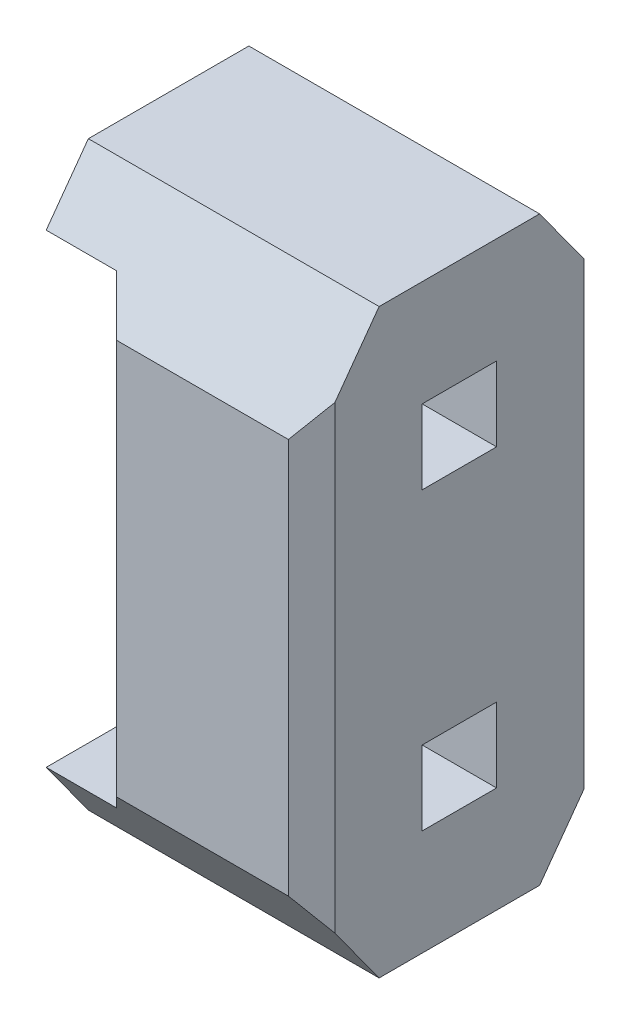
ISO-10303-21;
HEADER;
FILE_DESCRIPTION(('STEP AP214'),'2;1');
FILE_NAME('part.step','',(''),(''),'','','');
FILE_SCHEMA(('AUTOMOTIVE_DESIGN { 1 0 10303 214 1 1 1 1 }'));
ENDSEC;
DATA;
#1=APPLICATION_CONTEXT('core data for automotive mechanical design processes');
#2=APPLICATION_PROTOCOL_DEFINITION('international standard','automotive_design',2000,#1);
#3=PRODUCT_CONTEXT('',#1,'mechanical');
#4=PRODUCT('Part','Part','',(#3));
#5=PRODUCT_RELATED_PRODUCT_CATEGORY('part','',(#4));
#6=PRODUCT_DEFINITION_FORMATION('','',#4);
#7=PRODUCT_DEFINITION_CONTEXT('part definition',#1,'design');
#8=PRODUCT_DEFINITION('design','',#6,#7);
#9=PRODUCT_DEFINITION_SHAPE('','',#8);
#10=(LENGTH_UNIT() NAMED_UNIT(*) SI_UNIT(.MILLI.,.METRE.));
#11=(NAMED_UNIT(*) PLANE_ANGLE_UNIT() SI_UNIT($,.RADIAN.));
#12=(NAMED_UNIT(*) SI_UNIT($,.STERADIAN.) SOLID_ANGLE_UNIT());
#13=UNCERTAINTY_MEASURE_WITH_UNIT(LENGTH_MEASURE(1.E-05),#10,'distance_accuracy_value','');
#14=(GEOMETRIC_REPRESENTATION_CONTEXT(3) GLOBAL_UNCERTAINTY_ASSIGNED_CONTEXT((#13)) GLOBAL_UNIT_ASSIGNED_CONTEXT((#10,
#11,#12)) REPRESENTATION_CONTEXT('',''));
#15=CARTESIAN_POINT('',(0.,0.,0.));
#16=DIRECTION('',(0.,0.,1.));
#17=DIRECTION('',(1.,0.,0.));
#18=AXIS2_PLACEMENT_3D('',#15,#16,#17);
#19=CARTESIAN_POINT('',(1.25,4.6,-2.83));
#20=DIRECTION('',(0.,0.586967571460905,0.809610443394407));
#21=DIRECTION('',(0.,-0.809610443394407,0.586967571460905));
#22=AXIS2_PLACEMENT_3D('',#19,#20,#21);
#23=PLANE('',#22);
#24=DIRECTION('',(1.,0.,0.));
#25=VECTOR('',#24,1.);
#26=CARTESIAN_POINT('',(1.25,4.5,-2.7575));
#27=LINE('',#26,#25);
#28=CARTESIAN_POINT('',(0.,4.5,-2.7575));
#29=VERTEX_POINT('',#28);
#30=CARTESIAN_POINT('',(0.602500000000036,4.5,-2.75750000000004));
#31=VERTEX_POINT('',#30);
#32=EDGE_CURVE('E199',#29,#31,#27,.T.);
#33=ORIENTED_EDGE('',*,*,#32,.T.);
#34=DIRECTION('',(0.506207656349388,-0.698217457033655,0.506207656349365));
#35=VECTOR('',#34,1.);
#36=CARTESIAN_POINT('',(0.6025,4.5,-2.7575));
#37=LINE('',#36,#35);
#38=CARTESIAN_POINT('',(0.819999999999963,4.2,-2.53999999999997));
#39=VERTEX_POINT('',#38);
#40=EDGE_CURVE('E197',#31,#39,#37,.T.);
#41=ORIENTED_EDGE('',*,*,#40,.T.);
#42=DIRECTION('',(1.,0.,0.));
#43=VECTOR('',#42,1.);
#44=CARTESIAN_POINT('',(1.25,4.19999999999999,-2.54000000000001));
#45=LINE('',#44,#43);
#46=CARTESIAN_POINT('',(2.3,4.2,-2.54000000000001));
#47=VERTEX_POINT('',#46);
#48=EDGE_CURVE('E20',#39,#47,#45,.T.);
#49=ORIENTED_EDGE('',*,*,#48,.T.);
#50=DIRECTION('',(0.506207656348956,0.69821745703386,-0.506207656349513));
#51=VECTOR('',#50,1.);
#52=CARTESIAN_POINT('',(2.3,4.19999999999999,-2.54000000000001));
#53=LINE('',#52,#51);
#54=CARTESIAN_POINT('',(2.5,4.47586206896591,-2.74000000000012));
#55=VERTEX_POINT('',#54);
#56=EDGE_CURVE('E181',#47,#55,#53,.T.);
#57=ORIENTED_EDGE('',*,*,#56,.T.);
#58=DIRECTION('',(0.,-0.809610443394407,0.586967571460905));
#59=VECTOR('',#58,1.);
#60=CARTESIAN_POINT('',(2.5,4.6,-2.83));
#61=LINE('',#60,#59);
#62=CARTESIAN_POINT('',(2.5,5.,-3.11999999999999));
#63=VERTEX_POINT('',#62);
#64=EDGE_CURVE('E188',#55,#63,#61,.F.);
#65=ORIENTED_EDGE('',*,*,#64,.T.);
#66=DIRECTION('',(1.,0.,0.));
#67=VECTOR('',#66,1.);
#68=CARTESIAN_POINT('',(1.25,5.,-3.12));
#69=LINE('',#68,#67);
#70=CARTESIAN_POINT('',(0.,5.,-3.11999999999999));
#71=VERTEX_POINT('',#70);
#72=EDGE_CURVE('E215',#71,#63,#69,.T.);
#73=ORIENTED_EDGE('',*,*,#72,.F.);
#74=DIRECTION('',(0.,-0.809610443394407,0.586967571460905));
#75=VECTOR('',#74,1.);
#76=CARTESIAN_POINT('',(0.,4.6,-2.83));
#77=LINE('',#76,#75);
#78=EDGE_CURVE('E207',#71,#29,#77,.T.);
#79=ORIENTED_EDGE('',*,*,#78,.T.);
#80=EDGE_LOOP('',(#33,#41,#49,#57,#65,#73,#79));
#81=FACE_BOUND('',#80,.T.);
#82=ADVANCED_FACE('F17',(#81),#23,.T.);
#83=CARTESIAN_POINT('',(1.25,4.6,-4.79));
#84=DIRECTION('',(0.,-0.586967571460905,0.809610443394407));
#85=DIRECTION('',(0.,-0.809610443394407,-0.586967571460905));
#86=AXIS2_PLACEMENT_3D('',#83,#84,#85);
#87=PLANE('',#86);
#88=DIRECTION('',(0.,-0.809610443394407,-0.586967571460905));
#89=VECTOR('',#88,1.);
#90=CARTESIAN_POINT('',(0.,4.6,-4.79));
#91=LINE('',#90,#89);
#92=CARTESIAN_POINT('',(0.,5.,-4.50000000000001));
#93=VERTEX_POINT('',#92);
#94=CARTESIAN_POINT('',(0.,4.5,-4.8625));
#95=VERTEX_POINT('',#94);
#96=EDGE_CURVE('E263',#93,#95,#91,.T.);
#97=ORIENTED_EDGE('',*,*,#96,.F.);
#98=DIRECTION('',(1.,0.,0.));
#99=VECTOR('',#98,1.);
#100=CARTESIAN_POINT('',(1.25,5.,-4.5));
#101=LINE('',#100,#99);
#102=CARTESIAN_POINT('',(2.5,5.,-4.5));
#103=VERTEX_POINT('',#102);
#104=EDGE_CURVE('E227',#103,#93,#101,.F.);
#105=ORIENTED_EDGE('',*,*,#104,.F.);
#106=DIRECTION('',(0.,-0.809610443394407,-0.586967571460905));
#107=VECTOR('',#106,1.);
#108=CARTESIAN_POINT('',(2.5,4.6,-4.79));
#109=LINE('',#108,#107);
#110=CARTESIAN_POINT('',(2.5,4.47586206896592,-4.87999999999988));
#111=VERTEX_POINT('',#110);
#112=EDGE_CURVE('E223',#111,#103,#109,.F.);
#113=ORIENTED_EDGE('',*,*,#112,.F.);
#114=DIRECTION('',(0.506207656348956,0.69821745703386,0.506207656349513));
#115=VECTOR('',#114,1.);
#116=CARTESIAN_POINT('',(2.3,4.19999999999999,-5.07999999999999));
#117=LINE('',#116,#115);
#118=CARTESIAN_POINT('',(2.3,4.2,-5.07999999999999));
#119=VERTEX_POINT('',#118);
#120=EDGE_CURVE('E266',#119,#111,#117,.T.);
#121=ORIENTED_EDGE('',*,*,#120,.F.);
#122=DIRECTION('',(1.,0.,0.));
#123=VECTOR('',#122,1.);
#124=CARTESIAN_POINT('',(1.25,4.19999999999999,-5.07999999999999));
#125=LINE('',#124,#123);
#126=CARTESIAN_POINT('',(0.819999999999963,4.2,-5.08000000000003));
#127=VERTEX_POINT('',#126);
#128=EDGE_CURVE('E205',#127,#119,#125,.T.);
#129=ORIENTED_EDGE('',*,*,#128,.F.);
#130=DIRECTION('',(0.506207656349388,-0.698217457033654,-0.506207656349365));
#131=VECTOR('',#130,1.);
#132=CARTESIAN_POINT('',(0.6025,4.5,-4.8625));
#133=LINE('',#132,#131);
#134=CARTESIAN_POINT('',(0.602500000000036,4.5,-4.86249999999996));
#135=VERTEX_POINT('',#134);
#136=EDGE_CURVE('E203',#135,#127,#133,.T.);
#137=ORIENTED_EDGE('',*,*,#136,.F.);
#138=DIRECTION('',(1.,0.,0.));
#139=VECTOR('',#138,1.);
#140=CARTESIAN_POINT('',(1.25,4.5,-4.8625));
#141=LINE('',#140,#139);
#142=EDGE_CURVE('E261',#95,#135,#141,.T.);
#143=ORIENTED_EDGE('',*,*,#142,.F.);
#144=EDGE_LOOP('',(#97,#105,#113,#121,#129,#137,#143));
#145=FACE_BOUND('',#144,.T.);
#146=ADVANCED_FACE('F285',(#145),#87,.F.);
#147=CARTESIAN_POINT('',(1.25,0.4,-4.79));
#148=DIRECTION('',(0.,0.586967571460905,0.809610443394407));
#149=DIRECTION('',(0.,-0.809610443394407,0.586967571460905));
#150=AXIS2_PLACEMENT_3D('',#147,#148,#149);
#151=PLANE('',#150);
#152=DIRECTION('',(-0.506207656349403,0.698217457033647,-0.50620765634936));
#153=VECTOR('',#152,1.);
#154=CARTESIAN_POINT('',(2.5,0.524137931034497,-4.88));
#155=LINE('',#154,#153);
#156=CARTESIAN_POINT('',(2.5,0.524137931034498,-4.88));
#157=VERTEX_POINT('',#156);
#158=CARTESIAN_POINT('',(2.3,0.800000000000004,-5.07999999999999));
#159=VERTEX_POINT('',#158);
#160=EDGE_CURVE('E251',#157,#159,#155,.T.);
#161=ORIENTED_EDGE('',*,*,#160,.F.);
#162=DIRECTION('',(0.,-0.809610443394407,0.586967571460905));
#163=VECTOR('',#162,1.);
#164=CARTESIAN_POINT('',(2.5,0.4,-4.79));
#165=LINE('',#164,#163);
#166=CARTESIAN_POINT('',(2.5,0.,-4.5));
#167=VERTEX_POINT('',#166);
#168=EDGE_CURVE('E253',#167,#157,#165,.F.);
#169=ORIENTED_EDGE('',*,*,#168,.F.);
#170=DIRECTION('',(1.,0.,0.));
#171=VECTOR('',#170,1.);
#172=CARTESIAN_POINT('',(1.25,0.,-4.5));
#173=LINE('',#172,#171);
#174=CARTESIAN_POINT('',(0.,0.,-4.50000000000001));
#175=VERTEX_POINT('',#174);
#176=EDGE_CURVE('E288',#167,#175,#173,.F.);
#177=ORIENTED_EDGE('',*,*,#176,.T.);
#178=DIRECTION('',(0.,-0.809610443394407,0.586967571460905));
#179=VECTOR('',#178,1.);
#180=CARTESIAN_POINT('',(0.,0.4,-4.79));
#181=LINE('',#180,#179);
#182=CARTESIAN_POINT('',(0.,0.500000000000001,-4.8625));
#183=VERTEX_POINT('',#182);
#184=EDGE_CURVE('E255',#183,#175,#181,.T.);
#185=ORIENTED_EDGE('',*,*,#184,.F.);
#186=DIRECTION('',(1.,0.,0.));
#187=VECTOR('',#186,1.);
#188=CARTESIAN_POINT('',(1.25,0.500000000000002,-4.8625));
#189=LINE('',#188,#187);
#190=CARTESIAN_POINT('',(0.602500000000036,0.500000000000001,-4.86249999999996));
#191=VERTEX_POINT('',#190);
#192=EDGE_CURVE('E257',#191,#183,#189,.F.);
#193=ORIENTED_EDGE('',*,*,#192,.F.);
#194=DIRECTION('',(-0.506207656349387,-0.698217457033655,0.506207656349365));
#195=VECTOR('',#194,1.);
#196=CARTESIAN_POINT('',(0.82,0.80000000000001,-5.07999999999999));
#197=LINE('',#196,#195);
#198=CARTESIAN_POINT('',(0.819999999999963,0.800000000000005,-5.08000000000003));
#199=VERTEX_POINT('',#198);
#200=EDGE_CURVE('E259',#199,#191,#197,.T.);
#201=ORIENTED_EDGE('',*,*,#200,.F.);
#202=DIRECTION('',(1.,0.,0.));
#203=VECTOR('',#202,1.);
#204=CARTESIAN_POINT('',(1.25,0.80000000000001,-5.07999999999999));
#205=LINE('',#204,#203);
#206=EDGE_CURVE('E249',#159,#199,#205,.F.);
#207=ORIENTED_EDGE('',*,*,#206,.F.);
#208=EDGE_LOOP('',(#161,#169,#177,#185,#193,#201,#207));
#209=FACE_BOUND('',#208,.T.);
#210=ADVANCED_FACE('F431',(#209),#151,.F.);
#211=CARTESIAN_POINT('',(1.25,0.4,-2.83));
#212=DIRECTION('',(0.,-0.586967571460905,0.809610443394407));
#213=DIRECTION('',(0.,-0.809610443394407,-0.586967571460905));
#214=AXIS2_PLACEMENT_3D('',#211,#212,#213);
#215=PLANE('',#214);
#216=DIRECTION('',(1.,0.,0.));
#217=VECTOR('',#216,1.);
#218=CARTESIAN_POINT('',(1.25,0.800000000000009,-2.54000000000001));
#219=LINE('',#218,#217);
#220=CARTESIAN_POINT('',(2.3,0.800000000000004,-2.54000000000001));
#221=VERTEX_POINT('',#220);
#222=CARTESIAN_POINT('',(0.819999999999963,0.800000000000005,-2.53999999999997));
#223=VERTEX_POINT('',#222);
#224=EDGE_CURVE('E191',#221,#223,#219,.F.);
#225=ORIENTED_EDGE('',*,*,#224,.T.);
#226=DIRECTION('',(-0.506207656349387,-0.698217457033655,-0.506207656349365));
#227=VECTOR('',#226,1.);
#228=CARTESIAN_POINT('',(0.82,0.800000000000009,-2.54000000000001));
#229=LINE('',#228,#227);
#230=CARTESIAN_POINT('',(0.602500000000036,0.500000000000001,-2.75750000000004));
#231=VERTEX_POINT('',#230);
#232=EDGE_CURVE('E232',#223,#231,#229,.T.);
#233=ORIENTED_EDGE('',*,*,#232,.T.);
#234=DIRECTION('',(1.,0.,0.));
#235=VECTOR('',#234,1.);
#236=CARTESIAN_POINT('',(1.25,0.500000000000002,-2.7575));
#237=LINE('',#236,#235);
#238=CARTESIAN_POINT('',(0.,0.500000000000001,-2.7575));
#239=VERTEX_POINT('',#238);
#240=EDGE_CURVE('E246',#231,#239,#237,.F.);
#241=ORIENTED_EDGE('',*,*,#240,.T.);
#242=DIRECTION('',(0.,-0.809610443394407,-0.586967571460905));
#243=VECTOR('',#242,1.);
#244=CARTESIAN_POINT('',(0.,0.4,-2.83));
#245=LINE('',#244,#243);
#246=CARTESIAN_POINT('',(0.,0.,-3.11999999999999));
#247=VERTEX_POINT('',#246);
#248=EDGE_CURVE('E244',#239,#247,#245,.T.);
#249=ORIENTED_EDGE('',*,*,#248,.T.);
#250=DIRECTION('',(1.,0.,0.));
#251=VECTOR('',#250,1.);
#252=CARTESIAN_POINT('',(1.25,0.,-3.12));
#253=LINE('',#252,#251);
#254=CARTESIAN_POINT('',(2.5,0.,-3.12));
#255=VERTEX_POINT('',#254);
#256=EDGE_CURVE('E293',#247,#255,#253,.T.);
#257=ORIENTED_EDGE('',*,*,#256,.T.);
#258=DIRECTION('',(0.,-0.809610443394407,-0.586967571460905));
#259=VECTOR('',#258,1.);
#260=CARTESIAN_POINT('',(2.5,0.4,-2.83));
#261=LINE('',#260,#259);
#262=CARTESIAN_POINT('',(2.5,0.524137931034498,-2.74));
#263=VERTEX_POINT('',#262);
#264=EDGE_CURVE('E241',#255,#263,#261,.F.);
#265=ORIENTED_EDGE('',*,*,#264,.T.);
#266=DIRECTION('',(-0.506207656349403,0.698217457033647,0.506207656349359));
#267=VECTOR('',#266,1.);
#268=CARTESIAN_POINT('',(2.5,0.524137931034497,-2.74));
#269=LINE('',#268,#267);
#270=EDGE_CURVE('E239',#263,#221,#269,.T.);
#271=ORIENTED_EDGE('',*,*,#270,.T.);
#272=EDGE_LOOP('',(#225,#233,#241,#249,#257,#265,#271));
#273=FACE_BOUND('',#272,.T.);
#274=ADVANCED_FACE('F421',(#273),#215,.T.);
#275=CARTESIAN_POINT('',(1.25,5.,-3.81));
#276=DIRECTION('',(0.,1.,0.));
#277=DIRECTION('',(0.,0.,1.));
#278=AXIS2_PLACEMENT_3D('',#275,#276,#277);
#279=PLANE('',#278);
#280=ORIENTED_EDGE('',*,*,#104,.T.);
#281=DIRECTION('',(0.,0.,-1.));
#282=VECTOR('',#281,1.);
#283=CARTESIAN_POINT('',(0.,5.,-3.81));
#284=LINE('',#283,#282);
#285=EDGE_CURVE('E231',#93,#71,#284,.F.);
#286=ORIENTED_EDGE('',*,*,#285,.T.);
#287=ORIENTED_EDGE('',*,*,#72,.T.);
#288=DIRECTION('',(0.,0.,1.));
#289=VECTOR('',#288,1.);
#290=CARTESIAN_POINT('',(2.5,5.,-3.81));
#291=LINE('',#290,#289);
#292=EDGE_CURVE('E219',#63,#103,#291,.F.);
#293=ORIENTED_EDGE('',*,*,#292,.T.);
#294=EDGE_LOOP('',(#280,#286,#287,#293));
#295=FACE_BOUND('',#294,.T.);
#296=ADVANCED_FACE('F229',(#295),#279,.T.);
#297=CARTESIAN_POINT('',(1.25,0.,-3.81));
#298=DIRECTION('',(0.,1.,0.));
#299=DIRECTION('',(0.,0.,1.));
#300=AXIS2_PLACEMENT_3D('',#297,#298,#299);
#301=PLANE('',#300);
#302=DIRECTION('',(0.,0.,-1.));
#303=VECTOR('',#302,1.);
#304=CARTESIAN_POINT('',(0.,0.,-3.81));
#305=LINE('',#304,#303);
#306=EDGE_CURVE('E297',#247,#175,#305,.T.);
#307=ORIENTED_EDGE('',*,*,#306,.T.);
#308=ORIENTED_EDGE('',*,*,#176,.F.);
#309=DIRECTION('',(0.,0.,1.));
#310=VECTOR('',#309,1.);
#311=CARTESIAN_POINT('',(2.5,0.,-3.81));
#312=LINE('',#311,#310);
#313=EDGE_CURVE('E287',#255,#167,#312,.F.);
#314=ORIENTED_EDGE('',*,*,#313,.F.);
#315=ORIENTED_EDGE('',*,*,#256,.F.);
#316=EDGE_LOOP('',(#307,#308,#314,#315));
#317=FACE_BOUND('',#316,.T.);
#318=ADVANCED_FACE('F428',(#317),#301,.F.);
#319=CARTESIAN_POINT('',(0.,4.75,-3.81));
#320=DIRECTION('',(1.,0.,0.));
#321=DIRECTION('',(0.,0.,-1.));
#322=AXIS2_PLACEMENT_3D('',#319,#320,#321);
#323=PLANE('',#322);
#324=ORIENTED_EDGE('',*,*,#285,.F.);
#325=ORIENTED_EDGE('',*,*,#96,.T.);
#326=DIRECTION('',(0.,0.,1.));
#327=VECTOR('',#326,1.);
#328=CARTESIAN_POINT('',(0.,4.5,-3.81));
#329=LINE('',#328,#327);
#330=EDGE_CURVE('E307',#95,#29,#329,.T.);
#331=ORIENTED_EDGE('',*,*,#330,.T.);
#332=ORIENTED_EDGE('',*,*,#78,.F.);
#333=EDGE_LOOP('',(#324,#325,#331,#332));
#334=FACE_BOUND('',#333,.T.);
#335=ADVANCED_FACE('F441',(#334),#323,.F.);
#336=CARTESIAN_POINT('',(0.,0.25,-3.81));
#337=DIRECTION('',(1.,0.,0.));
#338=DIRECTION('',(0.,0.,-1.));
#339=AXIS2_PLACEMENT_3D('',#336,#337,#338);
#340=PLANE('',#339);
#341=ORIENTED_EDGE('',*,*,#306,.F.);
#342=ORIENTED_EDGE('',*,*,#248,.F.);
#343=DIRECTION('',(0.,0.,1.));
#344=VECTOR('',#343,1.);
#345=CARTESIAN_POINT('',(0.,0.5,-3.81));
#346=LINE('',#345,#344);
#347=EDGE_CURVE('E315',#183,#239,#346,.T.);
#348=ORIENTED_EDGE('',*,*,#347,.F.);
#349=ORIENTED_EDGE('',*,*,#184,.T.);
#350=EDGE_LOOP('',(#341,#342,#348,#349));
#351=FACE_BOUND('',#350,.T.);
#352=ADVANCED_FACE('F443',(#351),#340,.F.);
#353=CARTESIAN_POINT('',(1.55,3.45,-3.81));
#354=DIRECTION('',(0.,1.,0.));
#355=DIRECTION('',(0.,0.,1.));
#356=AXIS2_PLACEMENT_3D('',#353,#354,#355);
#357=PLANE('',#356);
#358=DIRECTION('',(1.,0.,0.));
#359=VECTOR('',#358,1.);
#360=CARTESIAN_POINT('',(1.55,3.45,-4.13));
#361=LINE('',#360,#359);
#362=CARTESIAN_POINT('',(0.6,3.45,-4.13));
#363=VERTEX_POINT('',#362);
#364=CARTESIAN_POINT('',(2.5,3.45,-4.13));
#365=VERTEX_POINT('',#364);
#366=EDGE_CURVE('E332',#363,#365,#361,.T.);
#367=ORIENTED_EDGE('',*,*,#366,.F.);
#368=DIRECTION('',(0.,0.,1.));
#369=VECTOR('',#368,1.);
#370=CARTESIAN_POINT('',(0.6,3.45,-3.81));
#371=LINE('',#370,#369);
#372=CARTESIAN_POINT('',(0.6,3.45,-3.49));
#373=VERTEX_POINT('',#372);
#374=EDGE_CURVE('E302',#363,#373,#371,.T.);
#375=ORIENTED_EDGE('',*,*,#374,.T.);
#376=DIRECTION('',(1.,0.,0.));
#377=VECTOR('',#376,1.);
#378=CARTESIAN_POINT('',(1.55,3.45,-3.49));
#379=LINE('',#378,#377);
#380=CARTESIAN_POINT('',(2.5,3.45,-3.49));
#381=VERTEX_POINT('',#380);
#382=EDGE_CURVE('E327',#373,#381,#379,.T.);
#383=ORIENTED_EDGE('',*,*,#382,.T.);
#384=DIRECTION('',(0.,0.,1.));
#385=VECTOR('',#384,1.);
#386=CARTESIAN_POINT('',(2.5,3.45,-3.81));
#387=LINE('',#386,#385);
#388=EDGE_CURVE('E300',#381,#365,#387,.F.);
#389=ORIENTED_EDGE('',*,*,#388,.T.);
#390=EDGE_LOOP('',(#367,#375,#383,#389));
#391=FACE_BOUND('',#390,.T.);
#392=ADVANCED_FACE('F398',(#391),#357,.T.);
#393=CARTESIAN_POINT('',(0.71,2.5,-4.97));
#394=DIRECTION('',(0.707106781187498,0.,0.707106781185598));
#395=DIRECTION('',(0.707106781185598,0.,-0.707106781187498));
#396=AXIS2_PLACEMENT_3D('',#393,#394,#395);
#397=PLANE('',#396);
#398=ORIENTED_EDGE('',*,*,#200,.T.);
#399=DIRECTION('',(0.707106781186701,0.,-0.707106781186394));
#400=VECTOR('',#399,1.);
#401=CARTESIAN_POINT('',(0.6,0.5,-4.86));
#402=LINE('',#401,#400);
#403=CARTESIAN_POINT('',(0.600000000000074,0.5,-4.85999999999993));
#404=VERTEX_POINT('',#403);
#405=EDGE_CURVE('E312',#404,#191,#402,.T.);
#406=ORIENTED_EDGE('',*,*,#405,.F.);
#407=DIRECTION('',(0.,1.,0.));
#408=VECTOR('',#407,1.);
#409=CARTESIAN_POINT('',(0.6,2.5,-4.86));
#410=LINE('',#409,#408);
#411=CARTESIAN_POINT('',(0.600000000000074,4.5,-4.85999999999993));
#412=VERTEX_POINT('',#411);
#413=EDGE_CURVE('E337',#404,#412,#410,.T.);
#414=ORIENTED_EDGE('',*,*,#413,.T.);
#415=DIRECTION('',(0.707106781186701,0.,-0.707106781186394));
#416=VECTOR('',#415,1.);
#417=CARTESIAN_POINT('',(0.6,4.5,-4.86));
#418=LINE('',#417,#416);
#419=EDGE_CURVE('E304',#412,#135,#418,.T.);
#420=ORIENTED_EDGE('',*,*,#419,.T.);
#421=ORIENTED_EDGE('',*,*,#136,.T.);
#422=DIRECTION('',(0.,1.,0.));
#423=VECTOR('',#422,1.);
#424=CARTESIAN_POINT('',(0.82,2.5,-5.08));
#425=LINE('',#424,#423);
#426=EDGE_CURVE('E275',#127,#199,#425,.F.);
#427=ORIENTED_EDGE('',*,*,#426,.T.);
#428=EDGE_LOOP('',(#398,#406,#414,#420,#421,#427));
#429=FACE_BOUND('',#428,.T.);
#430=ADVANCED_FACE('F435',(#429),#397,.F.);
#431=CARTESIAN_POINT('',(0.30125,4.5,-3.81));
#432=DIRECTION('',(0.,1.,0.));
#433=DIRECTION('',(0.,0.,1.));
#434=AXIS2_PLACEMENT_3D('',#431,#432,#433);
#435=PLANE('',#434);
#436=ORIENTED_EDGE('',*,*,#142,.T.);
#437=ORIENTED_EDGE('',*,*,#419,.F.);
#438=DIRECTION('',(0.,0.,-1.));
#439=VECTOR('',#438,1.);
#440=CARTESIAN_POINT('',(0.6,4.5,-3.81));
#441=LINE('',#440,#439);
#442=CARTESIAN_POINT('',(0.600000000000037,4.5,-2.76000000000004));
#443=VERTEX_POINT('',#442);
#444=EDGE_CURVE('E339',#412,#443,#441,.F.);
#445=ORIENTED_EDGE('',*,*,#444,.T.);
#446=DIRECTION('',(-0.707106781185598,0.,-0.707106781187498));
#447=VECTOR('',#446,1.);
#448=CARTESIAN_POINT('',(0.71,4.5,-2.65));
#449=LINE('',#448,#447);
#450=EDGE_CURVE('E310',#443,#31,#449,.F.);
#451=ORIENTED_EDGE('',*,*,#450,.T.);
#452=ORIENTED_EDGE('',*,*,#32,.F.);
#453=ORIENTED_EDGE('',*,*,#330,.F.);
#454=EDGE_LOOP('',(#436,#437,#445,#451,#452,#453));
#455=FACE_BOUND('',#454,.T.);
#456=ADVANCED_FACE('F439',(#455),#435,.F.);
#457=CARTESIAN_POINT('',(0.71,2.5,-2.65));
#458=DIRECTION('',(0.707106781187498,0.,-0.707106781185598));
#459=DIRECTION('',(-0.707106781185598,0.,-0.707106781187498));
#460=AXIS2_PLACEMENT_3D('',#457,#458,#459);
#461=PLANE('',#460);
#462=ORIENTED_EDGE('',*,*,#232,.F.);
#463=DIRECTION('',(0.,1.,0.));
#464=VECTOR('',#463,1.);
#465=CARTESIAN_POINT('',(0.82,2.5,-2.54));
#466=LINE('',#465,#464);
#467=EDGE_CURVE('E325',#39,#223,#466,.F.);
#468=ORIENTED_EDGE('',*,*,#467,.F.);
#469=ORIENTED_EDGE('',*,*,#40,.F.);
#470=ORIENTED_EDGE('',*,*,#450,.F.);
#471=DIRECTION('',(0.,1.,0.));
#472=VECTOR('',#471,1.);
#473=CARTESIAN_POINT('',(0.6,2.5,-2.76));
#474=LINE('',#473,#472);
#475=CARTESIAN_POINT('',(0.600000000000074,0.5,-2.76000000000007));
#476=VERTEX_POINT('',#475);
#477=EDGE_CURVE('E341',#443,#476,#474,.F.);
#478=ORIENTED_EDGE('',*,*,#477,.T.);
#479=DIRECTION('',(-0.707106781186578,0.,-0.707106781186517));
#480=VECTOR('',#479,1.);
#481=CARTESIAN_POINT('',(0.6025,0.5,-2.7575));
#482=LINE('',#481,#480);
#483=EDGE_CURVE('E318',#231,#476,#482,.T.);
#484=ORIENTED_EDGE('',*,*,#483,.F.);
#485=EDGE_LOOP('',(#462,#468,#469,#470,#478,#484));
#486=FACE_BOUND('',#485,.T.);
#487=ADVANCED_FACE('F416',(#486),#461,.F.);
#488=CARTESIAN_POINT('',(0.30125,0.5,-3.81));
#489=DIRECTION('',(0.,1.,0.));
#490=DIRECTION('',(0.,0.,1.));
#491=AXIS2_PLACEMENT_3D('',#488,#489,#490);
#492=PLANE('',#491);
#493=ORIENTED_EDGE('',*,*,#483,.T.);
#494=DIRECTION('',(0.,0.,-1.));
#495=VECTOR('',#494,1.);
#496=CARTESIAN_POINT('',(0.6,0.5,-3.81));
#497=LINE('',#496,#495);
#498=EDGE_CURVE('E343',#476,#404,#497,.T.);
#499=ORIENTED_EDGE('',*,*,#498,.T.);
#500=ORIENTED_EDGE('',*,*,#405,.T.);
#501=ORIENTED_EDGE('',*,*,#192,.T.);
#502=ORIENTED_EDGE('',*,*,#347,.T.);
#503=ORIENTED_EDGE('',*,*,#240,.F.);
#504=EDGE_LOOP('',(#493,#499,#500,#501,#502,#503));
#505=FACE_BOUND('',#504,.T.);
#506=ADVANCED_FACE('F418',(#505),#492,.T.);
#507=CARTESIAN_POINT('',(1.55,1.23,-4.13));
#508=DIRECTION('',(0.,0.,1.));
#509=DIRECTION('',(1.,0.,0.));
#510=AXIS2_PLACEMENT_3D('',#507,#508,#509);
#511=PLANE('',#510);
#512=DIRECTION('',(1.,0.,0.));
#513=VECTOR('',#512,1.);
#514=CARTESIAN_POINT('',(1.55,1.55,-4.13));
#515=LINE('',#514,#513);
#516=CARTESIAN_POINT('',(2.5,1.55,-4.13));
#517=VERTEX_POINT('',#516);
#518=CARTESIAN_POINT('',(0.6,1.55,-4.13));
#519=VERTEX_POINT('',#518);
#520=EDGE_CURVE('E283',#517,#519,#515,.F.);
#521=ORIENTED_EDGE('',*,*,#520,.T.);
#522=DIRECTION('',(0.,1.,0.));
#523=VECTOR('',#522,1.);
#524=CARTESIAN_POINT('',(0.6,2.5,-4.13));
#525=LINE('',#524,#523);
#526=CARTESIAN_POINT('',(0.6,0.91,-4.13));
#527=VERTEX_POINT('',#526);
#528=EDGE_CURVE('E346',#519,#527,#525,.F.);
#529=ORIENTED_EDGE('',*,*,#528,.T.);
#530=DIRECTION('',(1.,0.,0.));
#531=VECTOR('',#530,1.);
#532=CARTESIAN_POINT('',(1.55,0.91,-4.13));
#533=LINE('',#532,#531);
#534=CARTESIAN_POINT('',(2.5,0.91,-4.13));
#535=VERTEX_POINT('',#534);
#536=EDGE_CURVE('E354',#535,#527,#533,.F.);
#537=ORIENTED_EDGE('',*,*,#536,.F.);
#538=DIRECTION('',(0.,1.,0.));
#539=VECTOR('',#538,1.);
#540=CARTESIAN_POINT('',(2.5,1.23,-4.13));
#541=LINE('',#540,#539);
#542=EDGE_CURVE('E321',#535,#517,#541,.T.);
#543=ORIENTED_EDGE('',*,*,#542,.T.);
#544=EDGE_LOOP('',(#521,#529,#537,#543));
#545=FACE_BOUND('',#544,.T.);
#546=ADVANCED_FACE('F483',(#545),#511,.T.);
#547=CARTESIAN_POINT('',(1.56,2.5,-5.08));
#548=DIRECTION('',(0.,0.,1.));
#549=DIRECTION('',(1.,0.,0.));
#550=AXIS2_PLACEMENT_3D('',#547,#548,#549);
#551=PLANE('',#550);
#552=DIRECTION('',(0.,1.,0.));
#553=VECTOR('',#552,1.);
#554=CARTESIAN_POINT('',(2.3,2.5,-5.08));
#555=LINE('',#554,#553);
#556=EDGE_CURVE('E193',#159,#119,#555,.T.);
#557=ORIENTED_EDGE('',*,*,#556,.F.);
#558=ORIENTED_EDGE('',*,*,#206,.T.);
#559=ORIENTED_EDGE('',*,*,#426,.F.);
#560=ORIENTED_EDGE('',*,*,#128,.T.);
#561=EDGE_LOOP('',(#557,#558,#559,#560));
#562=FACE_BOUND('',#561,.T.);
#563=ADVANCED_FACE('F272',(#562),#551,.F.);
#564=CARTESIAN_POINT('',(1.56,2.5,-2.54));
#565=DIRECTION('',(0.,0.,1.));
#566=DIRECTION('',(1.,0.,0.));
#567=AXIS2_PLACEMENT_3D('',#564,#565,#566);
#568=PLANE('',#567);
#569=ORIENTED_EDGE('',*,*,#48,.F.);
#570=ORIENTED_EDGE('',*,*,#467,.T.);
#571=ORIENTED_EDGE('',*,*,#224,.F.);
#572=DIRECTION('',(0.,1.,0.));
#573=VECTOR('',#572,1.);
#574=CARTESIAN_POINT('',(2.3,2.5,-2.54));
#575=LINE('',#574,#573);
#576=EDGE_CURVE('E183',#47,#221,#575,.F.);
#577=ORIENTED_EDGE('',*,*,#576,.F.);
#578=EDGE_LOOP('',(#569,#570,#571,#577));
#579=FACE_BOUND('',#578,.T.);
#580=ADVANCED_FACE('F189',(#579),#568,.T.);
#581=CARTESIAN_POINT('',(1.55,3.77,-3.49));
#582=DIRECTION('',(0.,0.,1.));
#583=DIRECTION('',(1.,0.,0.));
#584=AXIS2_PLACEMENT_3D('',#581,#582,#583);
#585=PLANE('',#584);
#586=DIRECTION('',(0.,1.,0.));
#587=VECTOR('',#586,1.);
#588=CARTESIAN_POINT('',(2.5,3.77,-3.49));
#589=LINE('',#588,#587);
#590=CARTESIAN_POINT('',(2.5,4.09,-3.49));
#591=VERTEX_POINT('',#590);
#592=EDGE_CURVE('E330',#381,#591,#589,.T.);
#593=ORIENTED_EDGE('',*,*,#592,.F.);
#594=ORIENTED_EDGE('',*,*,#382,.F.);
#595=DIRECTION('',(0.,1.,0.));
#596=VECTOR('',#595,1.);
#597=CARTESIAN_POINT('',(0.6,2.5,-3.49));
#598=LINE('',#597,#596);
#599=CARTESIAN_POINT('',(0.6,4.09,-3.49));
#600=VERTEX_POINT('',#599);
#601=EDGE_CURVE('E351',#373,#600,#598,.T.);
#602=ORIENTED_EDGE('',*,*,#601,.T.);
#603=DIRECTION('',(1.,0.,0.));
#604=VECTOR('',#603,1.);
#605=CARTESIAN_POINT('',(1.55,4.09,-3.49));
#606=LINE('',#605,#604);
#607=EDGE_CURVE('E368',#600,#591,#606,.T.);
#608=ORIENTED_EDGE('',*,*,#607,.T.);
#609=EDGE_LOOP('',(#593,#594,#602,#608));
#610=FACE_BOUND('',#609,.T.);
#611=ADVANCED_FACE('F402',(#610),#585,.F.);
#612=CARTESIAN_POINT('',(1.55,3.77,-4.13));
#613=DIRECTION('',(0.,0.,1.));
#614=DIRECTION('',(1.,0.,0.));
#615=AXIS2_PLACEMENT_3D('',#612,#613,#614);
#616=PLANE('',#615);
#617=DIRECTION('',(1.,0.,0.));
#618=VECTOR('',#617,1.);
#619=CARTESIAN_POINT('',(1.55,4.09,-4.13));
#620=LINE('',#619,#618);
#621=CARTESIAN_POINT('',(2.5,4.09,-4.13));
#622=VERTEX_POINT('',#621);
#623=CARTESIAN_POINT('',(0.6,4.09,-4.13));
#624=VERTEX_POINT('',#623);
#625=EDGE_CURVE('E371',#622,#624,#620,.F.);
#626=ORIENTED_EDGE('',*,*,#625,.T.);
#627=DIRECTION('',(0.,1.,0.));
#628=VECTOR('',#627,1.);
#629=CARTESIAN_POINT('',(0.6,2.5,-4.13));
#630=LINE('',#629,#628);
#631=EDGE_CURVE('E348',#624,#363,#630,.F.);
#632=ORIENTED_EDGE('',*,*,#631,.T.);
#633=ORIENTED_EDGE('',*,*,#366,.T.);
#634=DIRECTION('',(0.,1.,0.));
#635=VECTOR('',#634,1.);
#636=CARTESIAN_POINT('',(2.5,3.77,-4.13));
#637=LINE('',#636,#635);
#638=EDGE_CURVE('E335',#365,#622,#637,.T.);
#639=ORIENTED_EDGE('',*,*,#638,.T.);
#640=EDGE_LOOP('',(#626,#632,#633,#639));
#641=FACE_BOUND('',#640,.T.);
#642=ADVANCED_FACE('F395',(#641),#616,.T.);
#643=CARTESIAN_POINT('',(0.6,2.5,-3.81));
#644=DIRECTION('',(1.,0.,0.));
#645=DIRECTION('',(0.,0.,-1.));
#646=AXIS2_PLACEMENT_3D('',#643,#644,#645);
#647=PLANE('',#646);
#648=ORIENTED_EDGE('',*,*,#374,.F.);
#649=ORIENTED_EDGE('',*,*,#631,.F.);
#650=DIRECTION('',(0.,0.,1.));
#651=VECTOR('',#650,1.);
#652=CARTESIAN_POINT('',(0.6,4.09,-3.81));
#653=LINE('',#652,#651);
#654=EDGE_CURVE('E192',#624,#600,#653,.T.);
#655=ORIENTED_EDGE('',*,*,#654,.T.);
#656=ORIENTED_EDGE('',*,*,#601,.F.);
#657=EDGE_LOOP('',(#648,#649,#655,#656));
#658=FACE_BOUND('',#657,.T.);
#659=ORIENTED_EDGE('',*,*,#528,.F.);
#660=DIRECTION('',(0.,0.,1.));
#661=VECTOR('',#660,1.);
#662=CARTESIAN_POINT('',(0.6,1.55,-3.81));
#663=LINE('',#662,#661);
#664=CARTESIAN_POINT('',(0.6,1.55,-3.49));
#665=VERTEX_POINT('',#664);
#666=EDGE_CURVE('E360',#519,#665,#663,.T.);
#667=ORIENTED_EDGE('',*,*,#666,.T.);
#668=DIRECTION('',(0.,1.,0.));
#669=VECTOR('',#668,1.);
#670=CARTESIAN_POINT('',(0.6,1.23,-3.49));
#671=LINE('',#670,#669);
#672=CARTESIAN_POINT('',(0.6,0.91,-3.49));
#673=VERTEX_POINT('',#672);
#674=EDGE_CURVE('E374',#665,#673,#671,.F.);
#675=ORIENTED_EDGE('',*,*,#674,.T.);
#676=DIRECTION('',(0.,0.,1.));
#677=VECTOR('',#676,1.);
#678=CARTESIAN_POINT('',(0.6,0.91,-3.81));
#679=LINE('',#678,#677);
#680=EDGE_CURVE('E357',#527,#673,#679,.T.);
#681=ORIENTED_EDGE('',*,*,#680,.F.);
#682=EDGE_LOOP('',(#659,#667,#675,#681));
#683=FACE_BOUND('',#682,.T.);
#684=ORIENTED_EDGE('',*,*,#477,.F.);
#685=ORIENTED_EDGE('',*,*,#444,.F.);
#686=ORIENTED_EDGE('',*,*,#413,.F.);
#687=ORIENTED_EDGE('',*,*,#498,.F.);
#688=EDGE_LOOP('',(#684,#685,#686,#687));
#689=FACE_BOUND('',#688,.T.);
#690=ADVANCED_FACE('F404',(#658,#683,#689),#647,.F.);
#691=CARTESIAN_POINT('',(1.55,0.91,-3.81));
#692=DIRECTION('',(0.,1.,0.));
#693=DIRECTION('',(0.,0.,1.));
#694=AXIS2_PLACEMENT_3D('',#691,#692,#693);
#695=PLANE('',#694);
#696=ORIENTED_EDGE('',*,*,#536,.T.);
#697=ORIENTED_EDGE('',*,*,#680,.T.);
#698=DIRECTION('',(1.,0.,0.));
#699=VECTOR('',#698,1.);
#700=CARTESIAN_POINT('',(1.55,0.91,-3.49));
#701=LINE('',#700,#699);
#702=CARTESIAN_POINT('',(2.5,0.91,-3.49));
#703=VERTEX_POINT('',#702);
#704=EDGE_CURVE('E376',#673,#703,#701,.T.);
#705=ORIENTED_EDGE('',*,*,#704,.T.);
#706=DIRECTION('',(0.,0.,1.));
#707=VECTOR('',#706,1.);
#708=CARTESIAN_POINT('',(2.5,0.91,-3.81));
#709=LINE('',#708,#707);
#710=EDGE_CURVE('E34',#703,#535,#709,.F.);
#711=ORIENTED_EDGE('',*,*,#710,.T.);
#712=EDGE_LOOP('',(#696,#697,#705,#711));
#713=FACE_BOUND('',#712,.T.);
#714=ADVANCED_FACE('F407',(#713),#695,.T.);
#715=CARTESIAN_POINT('',(1.55,1.55,-3.81));
#716=DIRECTION('',(0.,1.,0.));
#717=DIRECTION('',(0.,0.,1.));
#718=AXIS2_PLACEMENT_3D('',#715,#716,#717);
#719=PLANE('',#718);
#720=DIRECTION('',(0.,0.,1.));
#721=VECTOR('',#720,1.);
#722=CARTESIAN_POINT('',(2.5,1.55,-3.81));
#723=LINE('',#722,#721);
#724=CARTESIAN_POINT('',(2.5,1.55,-3.49));
#725=VERTEX_POINT('',#724);
#726=EDGE_CURVE('E362',#725,#517,#723,.F.);
#727=ORIENTED_EDGE('',*,*,#726,.F.);
#728=DIRECTION('',(1.,0.,0.));
#729=VECTOR('',#728,1.);
#730=CARTESIAN_POINT('',(1.55,1.55,-3.49));
#731=LINE('',#730,#729);
#732=EDGE_CURVE('E378',#725,#665,#731,.F.);
#733=ORIENTED_EDGE('',*,*,#732,.T.);
#734=ORIENTED_EDGE('',*,*,#666,.F.);
#735=ORIENTED_EDGE('',*,*,#520,.F.);
#736=EDGE_LOOP('',(#727,#733,#734,#735));
#737=FACE_BOUND('',#736,.T.);
#738=ADVANCED_FACE('F468',(#737),#719,.F.);
#739=CARTESIAN_POINT('',(2.4,2.5,-4.98));
#740=DIRECTION('',(0.707106781186548,0.,-0.707106781186548));
#741=DIRECTION('',(-0.707106781186548,0.,-0.707106781186548));
#742=AXIS2_PLACEMENT_3D('',#739,#740,#741);
#743=PLANE('',#742);
#744=DIRECTION('',(0.,1.,0.));
#745=VECTOR('',#744,1.);
#746=CARTESIAN_POINT('',(2.5,2.5,-4.88));
#747=LINE('',#746,#745);
#748=EDGE_CURVE('E381',#157,#111,#747,.T.);
#749=ORIENTED_EDGE('',*,*,#748,.F.);
#750=ORIENTED_EDGE('',*,*,#160,.T.);
#751=ORIENTED_EDGE('',*,*,#556,.T.);
#752=ORIENTED_EDGE('',*,*,#120,.T.);
#753=EDGE_LOOP('',(#749,#750,#751,#752));
#754=FACE_BOUND('',#753,.T.);
#755=ADVANCED_FACE('F281',(#754),#743,.T.);
#756=CARTESIAN_POINT('',(2.4,2.5,-2.64));
#757=DIRECTION('',(0.707106781186548,0.,0.707106781186548));
#758=DIRECTION('',(0.707106781186548,0.,-0.707106781186548));
#759=AXIS2_PLACEMENT_3D('',#756,#757,#758);
#760=PLANE('',#759);
#761=DIRECTION('',(0.,1.,0.));
#762=VECTOR('',#761,1.);
#763=CARTESIAN_POINT('',(2.5,2.5,-2.74));
#764=LINE('',#763,#762);
#765=EDGE_CURVE('E186',#55,#263,#764,.F.);
#766=ORIENTED_EDGE('',*,*,#765,.F.);
#767=ORIENTED_EDGE('',*,*,#56,.F.);
#768=ORIENTED_EDGE('',*,*,#576,.T.);
#769=ORIENTED_EDGE('',*,*,#270,.F.);
#770=EDGE_LOOP('',(#766,#767,#768,#769));
#771=FACE_BOUND('',#770,.T.);
#772=ADVANCED_FACE('F182',(#771),#760,.T.);
#773=CARTESIAN_POINT('',(1.55,4.09,-3.81));
#774=DIRECTION('',(0.,1.,0.));
#775=DIRECTION('',(0.,0.,1.));
#776=AXIS2_PLACEMENT_3D('',#773,#774,#775);
#777=PLANE('',#776);
#778=DIRECTION('',(0.,0.,-1.));
#779=VECTOR('',#778,1.);
#780=CARTESIAN_POINT('',(2.5,4.09,-3.81));
#781=LINE('',#780,#779);
#782=EDGE_CURVE('E26',#591,#622,#781,.T.);
#783=ORIENTED_EDGE('',*,*,#782,.F.);
#784=ORIENTED_EDGE('',*,*,#607,.F.);
#785=ORIENTED_EDGE('',*,*,#654,.F.);
#786=ORIENTED_EDGE('',*,*,#625,.F.);
#787=EDGE_LOOP('',(#783,#784,#785,#786));
#788=FACE_BOUND('',#787,.T.);
#789=ADVANCED_FACE('F392',(#788),#777,.F.);
#790=CARTESIAN_POINT('',(1.55,1.23,-3.49));
#791=DIRECTION('',(0.,0.,1.));
#792=DIRECTION('',(1.,0.,0.));
#793=AXIS2_PLACEMENT_3D('',#790,#791,#792);
#794=PLANE('',#793);
#795=DIRECTION('',(0.,1.,0.));
#796=VECTOR('',#795,1.);
#797=CARTESIAN_POINT('',(2.5,2.5,-3.49));
#798=LINE('',#797,#796);
#799=EDGE_CURVE('E11',#703,#725,#798,.T.);
#800=ORIENTED_EDGE('',*,*,#799,.F.);
#801=ORIENTED_EDGE('',*,*,#704,.F.);
#802=ORIENTED_EDGE('',*,*,#674,.F.);
#803=ORIENTED_EDGE('',*,*,#732,.F.);
#804=EDGE_LOOP('',(#800,#801,#802,#803));
#805=FACE_BOUND('',#804,.T.);
#806=ADVANCED_FACE('F454',(#805),#794,.F.);
#807=CARTESIAN_POINT('',(2.5,2.5,-3.81));
#808=DIRECTION('',(1.,0.,0.));
#809=DIRECTION('',(0.,0.,-1.));
#810=AXIS2_PLACEMENT_3D('',#807,#808,#809);
#811=PLANE('',#810);
#812=ORIENTED_EDGE('',*,*,#710,.F.);
#813=ORIENTED_EDGE('',*,*,#799,.T.);
#814=ORIENTED_EDGE('',*,*,#726,.T.);
#815=ORIENTED_EDGE('',*,*,#542,.F.);
#816=EDGE_LOOP('',(#812,#813,#814,#815));
#817=FACE_BOUND('',#816,.T.);
#818=ORIENTED_EDGE('',*,*,#592,.T.);
#819=ORIENTED_EDGE('',*,*,#782,.T.);
#820=ORIENTED_EDGE('',*,*,#638,.F.);
#821=ORIENTED_EDGE('',*,*,#388,.F.);
#822=EDGE_LOOP('',(#818,#819,#820,#821));
#823=FACE_BOUND('',#822,.T.);
#824=ORIENTED_EDGE('',*,*,#64,.F.);
#825=ORIENTED_EDGE('',*,*,#765,.T.);
#826=ORIENTED_EDGE('',*,*,#264,.F.);
#827=ORIENTED_EDGE('',*,*,#313,.T.);
#828=ORIENTED_EDGE('',*,*,#168,.T.);
#829=ORIENTED_EDGE('',*,*,#748,.T.);
#830=ORIENTED_EDGE('',*,*,#112,.T.);
#831=ORIENTED_EDGE('',*,*,#292,.F.);
#832=EDGE_LOOP('',(#824,#825,#826,#827,#828,#829,#830,#831));
#833=FACE_BOUND('',#832,.T.);
#834=ADVANCED_FACE('F220',(#817,#823,#833),#811,.T.);
#835=CLOSED_SHELL('',(#82,#146,#210,#274,#296,#318,#335,#352,#392,#430,#456,#487,#506,#546,#563,
#580,#611,#642,#690,#714,#738,#755,#772,#789,#806,#834));
#836=MANIFOLD_SOLID_BREP('B1',#835);
#837=ADVANCED_BREP_SHAPE_REPRESENTATION('',(#18,#836),#14);
#838=SHAPE_DEFINITION_REPRESENTATION(#9,#837);
ENDSEC;
END-ISO-10303-21;
